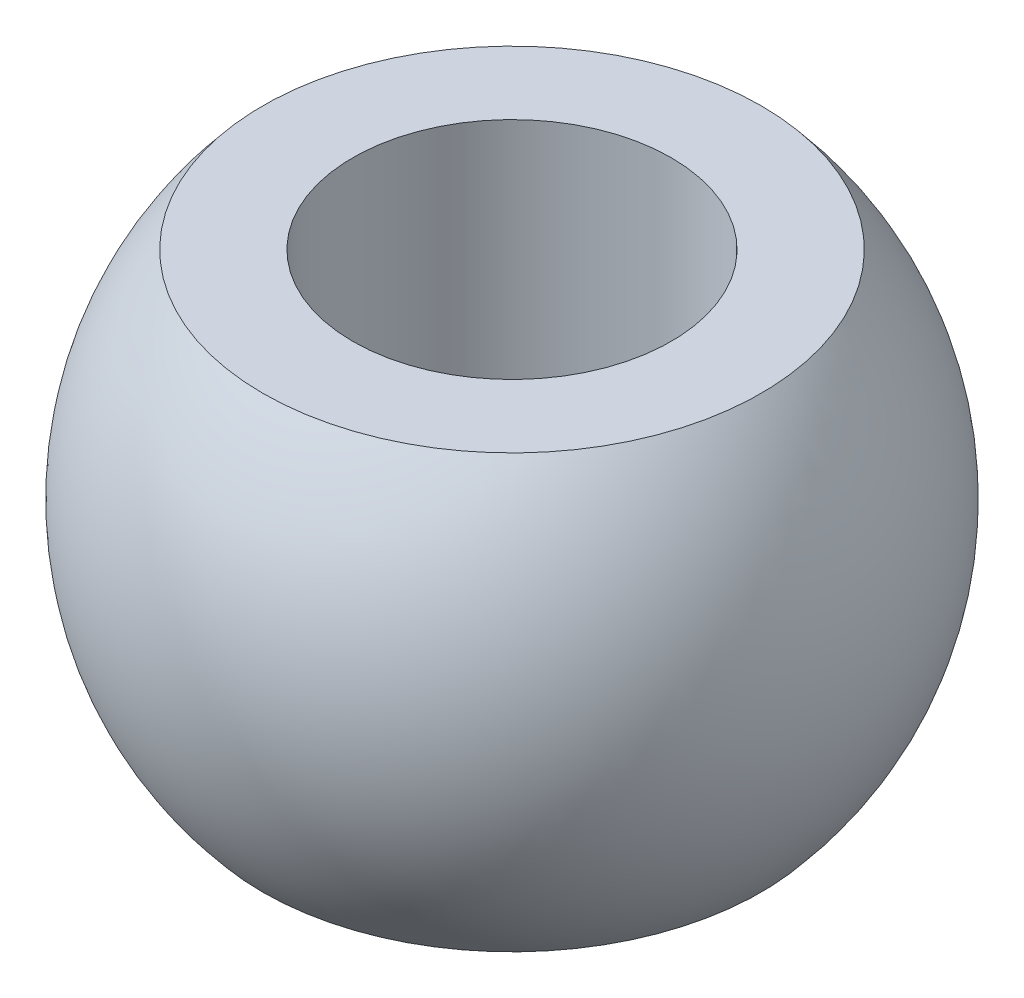
ISO-10303-21;
HEADER;
FILE_DESCRIPTION(('STEP AP214'),'2;1');
FILE_NAME('part.step','',(''),(''),'','','');
FILE_SCHEMA(('AUTOMOTIVE_DESIGN { 1 0 10303 214 1 1 1 1 }'));
ENDSEC;
DATA;
#1=APPLICATION_CONTEXT('core data for automotive mechanical design processes');
#2=APPLICATION_PROTOCOL_DEFINITION('international standard','automotive_design',2000,#1);
#3=PRODUCT_CONTEXT('',#1,'mechanical');
#4=PRODUCT('Part','Part','',(#3));
#5=PRODUCT_RELATED_PRODUCT_CATEGORY('part','',(#4));
#6=PRODUCT_DEFINITION_FORMATION('','',#4);
#7=PRODUCT_DEFINITION_CONTEXT('part definition',#1,'design');
#8=PRODUCT_DEFINITION('design','',#6,#7);
#9=PRODUCT_DEFINITION_SHAPE('','',#8);
#10=(LENGTH_UNIT() NAMED_UNIT(*) SI_UNIT(.MILLI.,.METRE.));
#11=(NAMED_UNIT(*) PLANE_ANGLE_UNIT() SI_UNIT($,.RADIAN.));
#12=(NAMED_UNIT(*) SI_UNIT($,.STERADIAN.) SOLID_ANGLE_UNIT());
#13=UNCERTAINTY_MEASURE_WITH_UNIT(LENGTH_MEASURE(1.E-05),#10,'distance_accuracy_value','');
#14=(GEOMETRIC_REPRESENTATION_CONTEXT(3) GLOBAL_UNCERTAINTY_ASSIGNED_CONTEXT((#13)) GLOBAL_UNIT_ASSIGNED_CONTEXT((#10,
#11,#12)) REPRESENTATION_CONTEXT('',''));
#15=CARTESIAN_POINT('',(0.,0.,0.));
#16=DIRECTION('',(0.,0.,1.));
#17=DIRECTION('',(1.,0.,0.));
#18=AXIS2_PLACEMENT_3D('',#15,#16,#17);
#19=CARTESIAN_POINT('',(0.,0.,0.));
#20=DIRECTION('',(0.,1.,0.));
#21=DIRECTION('',(0.,0.,1.));
#22=AXIS2_PLACEMENT_3D('',#19,#20,#21);
#23=CYLINDRICAL_SURFACE('',#22,7.);
#24=CARTESIAN_POINT('',(0.,-9.5,0.));
#25=DIRECTION('',(0.,1.,0.));
#26=DIRECTION('',(0.,0.,1.));
#27=AXIS2_PLACEMENT_3D('',#24,#25,#26);
#28=CIRCLE('',#27,7.);
#29=CARTESIAN_POINT('',(0.,-9.5,7.));
#30=VERTEX_POINT('',#29);
#31=EDGE_CURVE('E27',#30,#30,#28,.T.);
#32=ORIENTED_EDGE('',*,*,#31,.F.);
#33=EDGE_LOOP('',(#32));
#34=FACE_BOUND('',#33,.T.);
#35=CARTESIAN_POINT('',(0.,9.5,0.));
#36=DIRECTION('',(0.,1.,0.));
#37=DIRECTION('',(0.,0.,1.));
#38=AXIS2_PLACEMENT_3D('',#35,#36,#37);
#39=CIRCLE('',#38,7.);
#40=CARTESIAN_POINT('',(0.,9.5,7.));
#41=VERTEX_POINT('',#40);
#42=EDGE_CURVE('E18',#41,#41,#39,.F.);
#43=ORIENTED_EDGE('',*,*,#42,.F.);
#44=EDGE_LOOP('',(#43));
#45=FACE_BOUND('',#44,.T.);
#46=ADVANCED_FACE('F15',(#34,#45),#23,.F.);
#47=CARTESIAN_POINT('',(0.,9.5,0.));
#48=DIRECTION('',(0.,1.,0.));
#49=DIRECTION('',(0.,0.,1.));
#50=AXIS2_PLACEMENT_3D('',#47,#48,#49);
#51=PLANE('',#50);
#52=ORIENTED_EDGE('',*,*,#42,.T.);
#53=EDGE_LOOP('',(#52));
#54=FACE_BOUND('',#53,.T.);
#55=CARTESIAN_POINT('',(0.,9.5,0.));
#56=DIRECTION('',(0.,1.,0.));
#57=DIRECTION('',(0.,0.,1.));
#58=AXIS2_PLACEMENT_3D('',#55,#56,#57);
#59=CIRCLE('',#58,10.9544511501033);
#60=CARTESIAN_POINT('',(0.,9.5,10.9544511501033));
#61=VERTEX_POINT('',#60);
#62=EDGE_CURVE('E22',#61,#61,#59,.F.);
#63=ORIENTED_EDGE('',*,*,#62,.F.);
#64=EDGE_LOOP('',(#63));
#65=FACE_BOUND('',#64,.T.);
#66=ADVANCED_FACE('F37',(#54,#65),#51,.T.);
#67=CARTESIAN_POINT('',(0.,-9.5,0.));
#68=DIRECTION('',(0.,-1.,0.));
#69=DIRECTION('',(0.,0.,-1.));
#70=AXIS2_PLACEMENT_3D('',#67,#68,#69);
#71=PLANE('',#70);
#72=ORIENTED_EDGE('',*,*,#31,.T.);
#73=EDGE_LOOP('',(#72));
#74=FACE_BOUND('',#73,.T.);
#75=CARTESIAN_POINT('',(0.,-9.5,0.));
#76=DIRECTION('',(0.,1.,0.));
#77=DIRECTION('',(0.,0.,1.));
#78=AXIS2_PLACEMENT_3D('',#75,#76,#77);
#79=CIRCLE('',#78,10.9544511501033);
#80=CARTESIAN_POINT('',(0.,-9.5,10.9544511501033));
#81=VERTEX_POINT('',#80);
#82=EDGE_CURVE('E10',#81,#81,#79,.T.);
#83=ORIENTED_EDGE('',*,*,#82,.F.);
#84=EDGE_LOOP('',(#83));
#85=FACE_BOUND('',#84,.T.);
#86=ADVANCED_FACE('F46',(#74,#85),#71,.T.);
#87=CARTESIAN_POINT('',(0.,0.,0.));
#88=DIRECTION('',(0.,1.,0.));
#89=DIRECTION('',(-1.,0.,0.));
#90=AXIS2_PLACEMENT_3D('',#87,#88,#89);
#91=SPHERICAL_SURFACE('',#90,14.5);
#92=ORIENTED_EDGE('',*,*,#62,.T.);
#93=EDGE_LOOP('',(#92));
#94=FACE_BOUND('',#93,.T.);
#95=ORIENTED_EDGE('',*,*,#82,.T.);
#96=EDGE_LOOP('',(#95));
#97=FACE_BOUND('',#96,.T.);
#98=ADVANCED_FACE('F47',(#94,#97),#91,.T.);
#99=CLOSED_SHELL('',(#46,#66,#86,#98));
#100=MANIFOLD_SOLID_BREP('B1',#99);
#101=ADVANCED_BREP_SHAPE_REPRESENTATION('',(#18,#100),#14);
#102=SHAPE_DEFINITION_REPRESENTATION(#9,#101);
ENDSEC;
END-ISO-10303-21;
